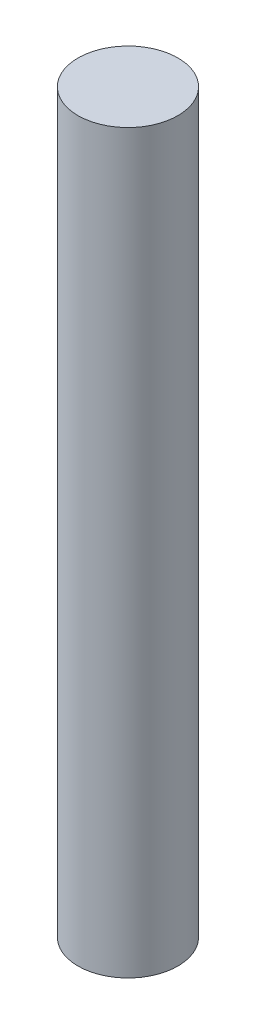
ISO-10303-21;
HEADER;
FILE_DESCRIPTION(('STEP AP214'),'2;1');
FILE_NAME('part.step','',(''),(''),'','','');
FILE_SCHEMA(('AUTOMOTIVE_DESIGN { 1 0 10303 214 1 1 1 1 }'));
ENDSEC;
DATA;
#1=APPLICATION_CONTEXT('core data for automotive mechanical design processes');
#2=APPLICATION_PROTOCOL_DEFINITION('international standard','automotive_design',2000,#1);
#3=PRODUCT_CONTEXT('',#1,'mechanical');
#4=PRODUCT('Part','Part','',(#3));
#5=PRODUCT_RELATED_PRODUCT_CATEGORY('part','',(#4));
#6=PRODUCT_DEFINITION_FORMATION('','',#4);
#7=PRODUCT_DEFINITION_CONTEXT('part definition',#1,'design');
#8=PRODUCT_DEFINITION('design','',#6,#7);
#9=PRODUCT_DEFINITION_SHAPE('','',#8);
#10=(LENGTH_UNIT() NAMED_UNIT(*) SI_UNIT(.MILLI.,.METRE.));
#11=(NAMED_UNIT(*) PLANE_ANGLE_UNIT() SI_UNIT($,.RADIAN.));
#12=(NAMED_UNIT(*) SI_UNIT($,.STERADIAN.) SOLID_ANGLE_UNIT());
#13=UNCERTAINTY_MEASURE_WITH_UNIT(LENGTH_MEASURE(1.E-05),#10,'distance_accuracy_value','');
#14=(GEOMETRIC_REPRESENTATION_CONTEXT(3) GLOBAL_UNCERTAINTY_ASSIGNED_CONTEXT((#13)) GLOBAL_UNIT_ASSIGNED_CONTEXT((#10,
#11,#12)) REPRESENTATION_CONTEXT('',''));
#15=CARTESIAN_POINT('',(0.,0.,0.));
#16=DIRECTION('',(0.,0.,1.));
#17=DIRECTION('',(1.,0.,0.));
#18=AXIS2_PLACEMENT_3D('',#15,#16,#17);
#19=CARTESIAN_POINT('',(0.,400.999999878,0.));
#20=DIRECTION('',(0.,-1.,0.));
#21=DIRECTION('',(0.,0.,-1.));
#22=AXIS2_PLACEMENT_3D('',#19,#20,#21);
#23=CYLINDRICAL_SURFACE('',#22,27.199999956);
#24=CARTESIAN_POINT('',(0.,400.999999878,0.));
#25=DIRECTION('',(0.,1.,0.));
#26=DIRECTION('',(0.,0.,1.));
#27=AXIS2_PLACEMENT_3D('',#24,#25,#26);
#28=CIRCLE('',#27,27.199999956);
#29=CARTESIAN_POINT('',(0.,400.999999878,27.199999956));
#30=VERTEX_POINT('',#29);
#31=EDGE_CURVE('E10',#30,#30,#28,.T.);
#32=ORIENTED_EDGE('',*,*,#31,.F.);
#33=EDGE_LOOP('',(#32));
#34=FACE_BOUND('',#33,.T.);
#35=CARTESIAN_POINT('',(0.,0.,0.));
#36=DIRECTION('',(0.,1.,0.));
#37=DIRECTION('',(0.,0.,1.));
#38=AXIS2_PLACEMENT_3D('',#35,#36,#37);
#39=CIRCLE('',#38,27.199999956);
#40=CARTESIAN_POINT('',(0.,0.,27.199999956));
#41=VERTEX_POINT('',#40);
#42=EDGE_CURVE('E38',#41,#41,#39,.T.);
#43=ORIENTED_EDGE('',*,*,#42,.T.);
#44=EDGE_LOOP('',(#43));
#45=FACE_BOUND('',#44,.T.);
#46=ADVANCED_FACE('F35',(#34,#45),#23,.T.);
#47=CARTESIAN_POINT('',(0.,400.999999878,0.));
#48=DIRECTION('',(0.,1.,0.));
#49=DIRECTION('',(0.,0.,1.));
#50=AXIS2_PLACEMENT_3D('',#47,#48,#49);
#51=PLANE('',#50);
#52=ORIENTED_EDGE('',*,*,#31,.T.);
#53=EDGE_LOOP('',(#52));
#54=FACE_BOUND('',#53,.T.);
#55=ADVANCED_FACE('F50',(#54),#51,.T.);
#56=CARTESIAN_POINT('',(0.,0.,0.));
#57=DIRECTION('',(0.,1.,0.));
#58=DIRECTION('',(0.,0.,1.));
#59=AXIS2_PLACEMENT_3D('',#56,#57,#58);
#60=PLANE('',#59);
#61=ORIENTED_EDGE('',*,*,#42,.F.);
#62=EDGE_LOOP('',(#61));
#63=FACE_BOUND('',#62,.T.);
#64=ADVANCED_FACE('F48',(#63),#60,.F.);
#65=CLOSED_SHELL('',(#46,#55,#64));
#66=MANIFOLD_SOLID_BREP('B2',#65);
#67=ADVANCED_BREP_SHAPE_REPRESENTATION('',(#18,#66),#14);
#68=SHAPE_DEFINITION_REPRESENTATION(#9,#67);
ENDSEC;
END-ISO-10303-21;
